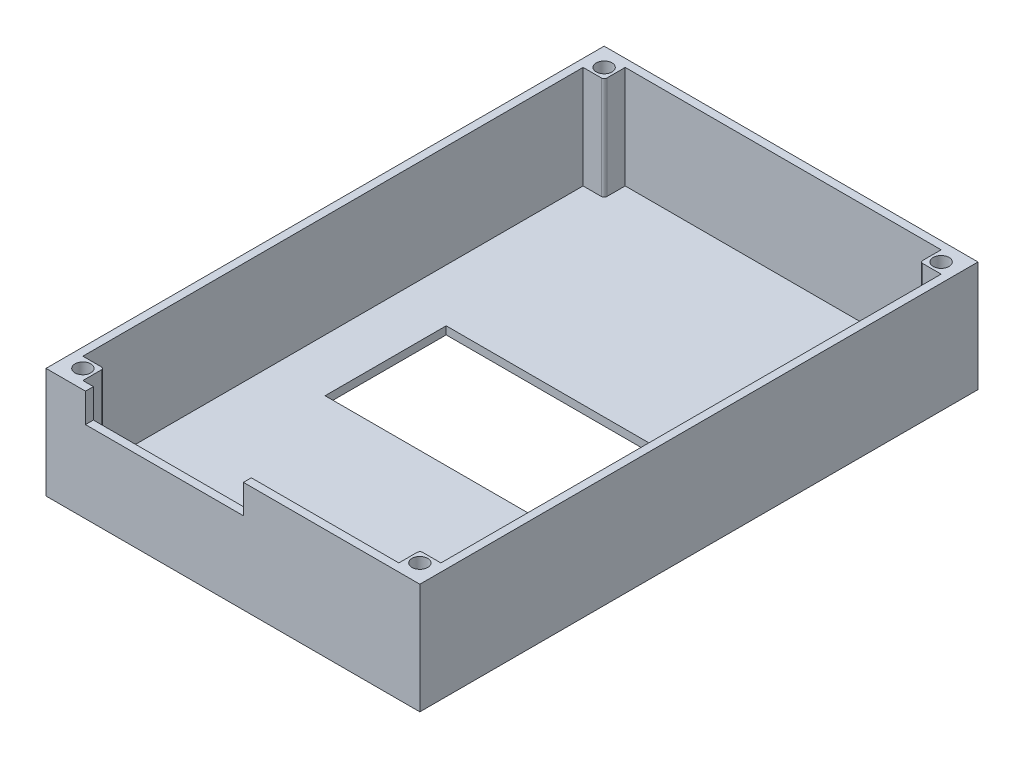
ISO-10303-21;
HEADER;
FILE_DESCRIPTION(('STEP AP214'),'2;1');
FILE_NAME('part.step','',(''),(''),'','','');
FILE_SCHEMA(('AUTOMOTIVE_DESIGN { 1 0 10303 214 1 1 1 1 }'));
ENDSEC;
DATA;
#1=APPLICATION_CONTEXT('core data for automotive mechanical design processes');
#2=APPLICATION_PROTOCOL_DEFINITION('international standard','automotive_design',2000,#1);
#3=PRODUCT_CONTEXT('',#1,'mechanical');
#4=PRODUCT('Part','Part','',(#3));
#5=PRODUCT_RELATED_PRODUCT_CATEGORY('part','',(#4));
#6=PRODUCT_DEFINITION_FORMATION('','',#4);
#7=PRODUCT_DEFINITION_CONTEXT('part definition',#1,'design');
#8=PRODUCT_DEFINITION('design','',#6,#7);
#9=PRODUCT_DEFINITION_SHAPE('','',#8);
#10=(LENGTH_UNIT() NAMED_UNIT(*) SI_UNIT(.MILLI.,.METRE.));
#11=(NAMED_UNIT(*) PLANE_ANGLE_UNIT() SI_UNIT($,.RADIAN.));
#12=(NAMED_UNIT(*) SI_UNIT($,.STERADIAN.) SOLID_ANGLE_UNIT());
#13=UNCERTAINTY_MEASURE_WITH_UNIT(LENGTH_MEASURE(1.E-05),#10,'distance_accuracy_value','');
#14=(GEOMETRIC_REPRESENTATION_CONTEXT(3) GLOBAL_UNCERTAINTY_ASSIGNED_CONTEXT((#13)) GLOBAL_UNIT_ASSIGNED_CONTEXT((#10,
#11,#12)) REPRESENTATION_CONTEXT('',''));
#15=CARTESIAN_POINT('',(0.,0.,0.));
#16=DIRECTION('',(0.,0.,1.));
#17=DIRECTION('',(1.,0.,0.));
#18=AXIS2_PLACEMENT_3D('',#15,#16,#17);
#19=CARTESIAN_POINT('',(34.,21.,53.));
#20=DIRECTION('',(-1.,0.,0.));
#21=DIRECTION('',(0.,0.,1.));
#22=AXIS2_PLACEMENT_3D('',#19,#20,#21);
#23=PLANE('',#22);
#24=DIRECTION('',(0.,0.,-1.));
#25=VECTOR('',#24,1.);
#26=CARTESIAN_POINT('',(34.,1.5,0.));
#27=LINE('',#26,#25);
#28=CARTESIAN_POINT('',(34.,1.5,47.5));
#29=VERTEX_POINT('',#28);
#30=CARTESIAN_POINT('',(34.,1.5,-47.5));
#31=VERTEX_POINT('',#30);
#32=EDGE_CURVE('E461',#29,#31,#27,.T.);
#33=ORIENTED_EDGE('',*,*,#32,.F.);
#34=DIRECTION('',(0.,-1.,0.));
#35=VECTOR('',#34,1.);
#36=CARTESIAN_POINT('',(34.,26.6568542494924,47.5));
#37=LINE('',#36,#35);
#38=CARTESIAN_POINT('',(34.,21.,47.5));
#39=VERTEX_POINT('',#38);
#40=EDGE_CURVE('E291',#39,#29,#37,.T.);
#41=ORIENTED_EDGE('',*,*,#40,.F.);
#42=DIRECTION('',(0.,0.,-1.));
#43=VECTOR('',#42,1.);
#44=CARTESIAN_POINT('',(34.,21.,0.));
#45=LINE('',#44,#43);
#46=CARTESIAN_POINT('',(34.,21.,-47.5));
#47=VERTEX_POINT('',#46);
#48=EDGE_CURVE('E483',#39,#47,#45,.T.);
#49=ORIENTED_EDGE('',*,*,#48,.T.);
#50=DIRECTION('',(0.,-1.,0.));
#51=VECTOR('',#50,1.);
#52=CARTESIAN_POINT('',(34.,26.6568542494924,-47.5));
#53=LINE('',#52,#51);
#54=EDGE_CURVE('E345',#47,#31,#53,.T.);
#55=ORIENTED_EDGE('',*,*,#54,.T.);
#56=EDGE_LOOP('',(#33,#41,#49,#55));
#57=FACE_BOUND('',#56,.T.);
#58=ADVANCED_FACE('F39',(#57),#23,.T.);
#59=CARTESIAN_POINT('',(-35.5,21.,51.5));
#60=DIRECTION('',(0.,0.,-1.));
#61=DIRECTION('',(-1.,0.,0.));
#62=AXIS2_PLACEMENT_3D('',#59,#60,#61);
#63=PLANE('',#62);
#64=DIRECTION('',(1.,0.,0.));
#65=VECTOR('',#64,1.);
#66=CARTESIAN_POINT('',(0.,21.,51.5));
#67=LINE('',#66,#65);
#68=CARTESIAN_POINT('',(1.99999999999998,21.,51.5));
#69=VERTEX_POINT('',#68);
#70=CARTESIAN_POINT('',(30.,21.,51.5));
#71=VERTEX_POINT('',#70);
#72=EDGE_CURVE('E493',#69,#71,#67,.T.);
#73=ORIENTED_EDGE('',*,*,#72,.T.);
#74=DIRECTION('',(0.,-1.,0.));
#75=VECTOR('',#74,1.);
#76=CARTESIAN_POINT('',(30.,26.6568542494924,51.5));
#77=LINE('',#76,#75);
#78=CARTESIAN_POINT('',(30.,1.5,51.5));
#79=VERTEX_POINT('',#78);
#80=EDGE_CURVE('E278',#71,#79,#77,.T.);
#81=ORIENTED_EDGE('',*,*,#80,.T.);
#82=DIRECTION('',(1.,0.,0.));
#83=VECTOR('',#82,1.);
#84=CARTESIAN_POINT('',(0.,1.5,51.5));
#85=LINE('',#84,#83);
#86=CARTESIAN_POINT('',(-30.,1.5,51.5));
#87=VERTEX_POINT('',#86);
#88=EDGE_CURVE('E480',#87,#79,#85,.T.);
#89=ORIENTED_EDGE('',*,*,#88,.F.);
#90=DIRECTION('',(0.,-1.,0.));
#91=VECTOR('',#90,1.);
#92=CARTESIAN_POINT('',(-30.,26.6568542494924,51.5));
#93=LINE('',#92,#91);
#94=CARTESIAN_POINT('',(-30.,21.,51.5));
#95=VERTEX_POINT('',#94);
#96=EDGE_CURVE('E369',#95,#87,#93,.T.);
#97=ORIENTED_EDGE('',*,*,#96,.F.);
#98=CARTESIAN_POINT('',(-28.,21.,51.5));
#99=VERTEX_POINT('',#98);
#100=EDGE_CURVE('E494',#95,#99,#67,.T.);
#101=ORIENTED_EDGE('',*,*,#100,.T.);
#102=DIRECTION('',(0.,1.,0.));
#103=VECTOR('',#102,1.);
#104=CARTESIAN_POINT('',(-28.,21.,51.5));
#105=LINE('',#104,#103);
#106=CARTESIAN_POINT('',(-28.,15.5,51.5));
#107=VERTEX_POINT('',#106);
#108=EDGE_CURVE('E548',#107,#99,#105,.T.);
#109=ORIENTED_EDGE('',*,*,#108,.F.);
#110=DIRECTION('',(-1.,0.,0.));
#111=VECTOR('',#110,1.);
#112=CARTESIAN_POINT('',(-35.5,15.5,51.5));
#113=LINE('',#112,#111);
#114=CARTESIAN_POINT('',(1.99999999999997,15.5,51.5));
#115=VERTEX_POINT('',#114);
#116=EDGE_CURVE('E541',#115,#107,#113,.T.);
#117=ORIENTED_EDGE('',*,*,#116,.F.);
#118=DIRECTION('',(0.,-1.,0.));
#119=VECTOR('',#118,1.);
#120=CARTESIAN_POINT('',(1.99999999999997,21.,51.5));
#121=LINE('',#120,#119);
#122=EDGE_CURVE('E544',#69,#115,#121,.T.);
#123=ORIENTED_EDGE('',*,*,#122,.F.);
#124=EDGE_LOOP('',(#73,#81,#89,#97,#101,#109,#117,#123));
#125=FACE_BOUND('',#124,.T.);
#126=ADVANCED_FACE('F586',(#125),#63,.T.);
#127=CARTESIAN_POINT('',(-35.5,21.,-51.5));
#128=DIRECTION('',(0.,0.,1.));
#129=DIRECTION('',(1.,0.,0.));
#130=AXIS2_PLACEMENT_3D('',#127,#128,#129);
#131=PLANE('',#130);
#132=DIRECTION('',(0.,-1.,0.));
#133=VECTOR('',#132,1.);
#134=CARTESIAN_POINT('',(30.,26.6568542494924,-51.5));
#135=LINE('',#134,#133);
#136=CARTESIAN_POINT('',(30.,21.,-51.5));
#137=VERTEX_POINT('',#136);
#138=CARTESIAN_POINT('',(30.,1.5,-51.5));
#139=VERTEX_POINT('',#138);
#140=EDGE_CURVE('E331',#137,#139,#135,.T.);
#141=ORIENTED_EDGE('',*,*,#140,.F.);
#142=DIRECTION('',(-1.,0.,0.));
#143=VECTOR('',#142,1.);
#144=CARTESIAN_POINT('',(0.,21.,-51.5));
#145=LINE('',#144,#143);
#146=CARTESIAN_POINT('',(-30.,21.,-51.5));
#147=VERTEX_POINT('',#146);
#148=EDGE_CURVE('E486',#137,#147,#145,.T.);
#149=ORIENTED_EDGE('',*,*,#148,.T.);
#150=DIRECTION('',(0.,-1.,0.));
#151=VECTOR('',#150,1.);
#152=CARTESIAN_POINT('',(-30.,26.6568542494924,-51.5));
#153=LINE('',#152,#151);
#154=CARTESIAN_POINT('',(-30.,1.5,-51.5));
#155=VERTEX_POINT('',#154);
#156=EDGE_CURVE('E403',#147,#155,#153,.T.);
#157=ORIENTED_EDGE('',*,*,#156,.T.);
#158=DIRECTION('',(-1.,0.,0.));
#159=VECTOR('',#158,1.);
#160=CARTESIAN_POINT('',(0.,1.5,-51.5));
#161=LINE('',#160,#159);
#162=EDGE_CURVE('E473',#139,#155,#161,.T.);
#163=ORIENTED_EDGE('',*,*,#162,.F.);
#164=EDGE_LOOP('',(#141,#149,#157,#163));
#165=FACE_BOUND('',#164,.T.);
#166=ADVANCED_FACE('F592',(#165),#131,.T.);
#167=CARTESIAN_POINT('',(-34.,21.,53.));
#168=DIRECTION('',(1.,0.,0.));
#169=DIRECTION('',(0.,0.,-1.));
#170=AXIS2_PLACEMENT_3D('',#167,#168,#169);
#171=PLANE('',#170);
#172=DIRECTION('',(0.,-1.,0.));
#173=VECTOR('',#172,1.);
#174=CARTESIAN_POINT('',(-34.,26.6568542494924,47.5));
#175=LINE('',#174,#173);
#176=CARTESIAN_POINT('',(-34.,21.,47.5));
#177=VERTEX_POINT('',#176);
#178=CARTESIAN_POINT('',(-34.,1.5,47.5));
#179=VERTEX_POINT('',#178);
#180=EDGE_CURVE('E383',#177,#179,#175,.T.);
#181=ORIENTED_EDGE('',*,*,#180,.T.);
#182=DIRECTION('',(0.,0.,1.));
#183=VECTOR('',#182,1.);
#184=CARTESIAN_POINT('',(-34.,1.5,0.));
#185=LINE('',#184,#183);
#186=CARTESIAN_POINT('',(-34.,1.5,-47.5));
#187=VERTEX_POINT('',#186);
#188=EDGE_CURVE('E476',#187,#179,#185,.T.);
#189=ORIENTED_EDGE('',*,*,#188,.F.);
#190=DIRECTION('',(0.,-1.,0.));
#191=VECTOR('',#190,1.);
#192=CARTESIAN_POINT('',(-34.,26.6568542494924,-47.5));
#193=LINE('',#192,#191);
#194=CARTESIAN_POINT('',(-34.,21.,-47.5));
#195=VERTEX_POINT('',#194);
#196=EDGE_CURVE('E416',#195,#187,#193,.T.);
#197=ORIENTED_EDGE('',*,*,#196,.F.);
#198=DIRECTION('',(0.,0.,1.));
#199=VECTOR('',#198,1.);
#200=CARTESIAN_POINT('',(-34.,21.,0.));
#201=LINE('',#200,#199);
#202=EDGE_CURVE('E489',#195,#177,#201,.T.);
#203=ORIENTED_EDGE('',*,*,#202,.T.);
#204=EDGE_LOOP('',(#181,#189,#197,#203));
#205=FACE_BOUND('',#204,.T.);
#206=ADVANCED_FACE('F601',(#205),#171,.T.);
#207=CARTESIAN_POINT('',(0.,21.,0.));
#208=DIRECTION('',(0.,-1.,0.));
#209=DIRECTION('',(0.,0.,-1.));
#210=AXIS2_PLACEMENT_3D('',#207,#208,#209);
#211=PLANE('',#210);
#212=ORIENTED_EDGE('',*,*,#48,.F.);
#213=DIRECTION('',(1.,0.,0.));
#214=VECTOR('',#213,1.);
#215=CARTESIAN_POINT('',(34.,21.,47.5));
#216=LINE('',#215,#214);
#217=CARTESIAN_POINT('',(30.5,21.,47.5));
#218=VERTEX_POINT('',#217);
#219=EDGE_CURVE('E295',#218,#39,#216,.T.);
#220=ORIENTED_EDGE('',*,*,#219,.F.);
#221=CARTESIAN_POINT('',(30.5,21.,48.));
#222=DIRECTION('',(0.,-1.,0.));
#223=DIRECTION('',(0.,0.,-1.));
#224=AXIS2_PLACEMENT_3D('',#221,#222,#223);
#225=CIRCLE('',#224,0.500000000000006);
#226=CARTESIAN_POINT('',(30.,21.,48.));
#227=VERTEX_POINT('',#226);
#228=EDGE_CURVE('E290',#227,#218,#225,.T.);
#229=ORIENTED_EDGE('',*,*,#228,.F.);
#230=DIRECTION('',(0.,0.,-1.));
#231=VECTOR('',#230,1.);
#232=CARTESIAN_POINT('',(30.,21.,51.5));
#233=LINE('',#232,#231);
#234=EDGE_CURVE('E284',#71,#227,#233,.T.);
#235=ORIENTED_EDGE('',*,*,#234,.F.);
#236=ORIENTED_EDGE('',*,*,#72,.F.);
#237=DIRECTION('',(0.,0.,1.));
#238=VECTOR('',#237,1.);
#239=CARTESIAN_POINT('',(1.99999999999998,21.,32.));
#240=LINE('',#239,#238);
#241=CARTESIAN_POINT('',(1.99999999999998,21.,53.));
#242=VERTEX_POINT('',#241);
#243=EDGE_CURVE('E462',#69,#242,#240,.T.);
#244=ORIENTED_EDGE('',*,*,#243,.T.);
#245=DIRECTION('',(1.,0.,0.));
#246=VECTOR('',#245,1.);
#247=CARTESIAN_POINT('',(-35.5,21.,53.));
#248=LINE('',#247,#246);
#249=CARTESIAN_POINT('',(35.5,21.,53.));
#250=VERTEX_POINT('',#249);
#251=EDGE_CURVE('E509',#242,#250,#248,.T.);
#252=ORIENTED_EDGE('',*,*,#251,.T.);
#253=DIRECTION('',(0.,0.,-1.));
#254=VECTOR('',#253,1.);
#255=CARTESIAN_POINT('',(35.5,21.,53.));
#256=LINE('',#255,#254);
#257=CARTESIAN_POINT('',(35.5,21.,-53.));
#258=VERTEX_POINT('',#257);
#259=EDGE_CURVE('E498',#250,#258,#256,.T.);
#260=ORIENTED_EDGE('',*,*,#259,.T.);
#261=DIRECTION('',(-1.,0.,0.));
#262=VECTOR('',#261,1.);
#263=CARTESIAN_POINT('',(-35.5,21.,-53.));
#264=LINE('',#263,#262);
#265=CARTESIAN_POINT('',(-35.5,21.,-53.));
#266=VERTEX_POINT('',#265);
#267=EDGE_CURVE('E502',#258,#266,#264,.T.);
#268=ORIENTED_EDGE('',*,*,#267,.T.);
#269=DIRECTION('',(0.,0.,1.));
#270=VECTOR('',#269,1.);
#271=CARTESIAN_POINT('',(-35.5,21.,53.));
#272=LINE('',#271,#270);
#273=CARTESIAN_POINT('',(-35.5,21.,53.));
#274=VERTEX_POINT('',#273);
#275=EDGE_CURVE('E506',#266,#274,#272,.T.);
#276=ORIENTED_EDGE('',*,*,#275,.T.);
#277=CARTESIAN_POINT('',(-28.,21.,53.));
#278=VERTEX_POINT('',#277);
#279=EDGE_CURVE('E510',#274,#278,#248,.T.);
#280=ORIENTED_EDGE('',*,*,#279,.T.);
#281=DIRECTION('',(0.,0.,1.));
#282=VECTOR('',#281,1.);
#283=CARTESIAN_POINT('',(-28.,21.,32.));
#284=LINE('',#283,#282);
#285=EDGE_CURVE('E458',#99,#278,#284,.T.);
#286=ORIENTED_EDGE('',*,*,#285,.F.);
#287=ORIENTED_EDGE('',*,*,#100,.F.);
#288=DIRECTION('',(0.,0.,-1.));
#289=VECTOR('',#288,1.);
#290=CARTESIAN_POINT('',(-30.,21.,51.5));
#291=LINE('',#290,#289);
#292=CARTESIAN_POINT('',(-30.,21.,48.));
#293=VERTEX_POINT('',#292);
#294=EDGE_CURVE('E365',#95,#293,#291,.T.);
#295=ORIENTED_EDGE('',*,*,#294,.T.);
#296=CARTESIAN_POINT('',(-30.5,21.,48.));
#297=DIRECTION('',(0.,-1.,0.));
#298=DIRECTION('',(0.,0.,-1.));
#299=AXIS2_PLACEMENT_3D('',#296,#297,#298);
#300=CIRCLE('',#299,0.500000000000006);
#301=CARTESIAN_POINT('',(-30.5,21.,47.5));
#302=VERTEX_POINT('',#301);
#303=EDGE_CURVE('E366',#293,#302,#300,.F.);
#304=ORIENTED_EDGE('',*,*,#303,.T.);
#305=DIRECTION('',(-1.,0.,0.));
#306=VECTOR('',#305,1.);
#307=CARTESIAN_POINT('',(-34.,21.,47.5));
#308=LINE('',#307,#306);
#309=EDGE_CURVE('E361',#302,#177,#308,.T.);
#310=ORIENTED_EDGE('',*,*,#309,.T.);
#311=ORIENTED_EDGE('',*,*,#202,.F.);
#312=DIRECTION('',(-1.,0.,0.));
#313=VECTOR('',#312,1.);
#314=CARTESIAN_POINT('',(-34.,21.,-47.5));
#315=LINE('',#314,#313);
#316=CARTESIAN_POINT('',(-30.5,21.,-47.5));
#317=VERTEX_POINT('',#316);
#318=EDGE_CURVE('E420',#317,#195,#315,.T.);
#319=ORIENTED_EDGE('',*,*,#318,.F.);
#320=CARTESIAN_POINT('',(-30.5,21.,-48.));
#321=DIRECTION('',(0.,-1.,0.));
#322=DIRECTION('',(0.,0.,-1.));
#323=AXIS2_PLACEMENT_3D('',#320,#321,#322);
#324=CIRCLE('',#323,0.500000000000006);
#325=CARTESIAN_POINT('',(-30.,21.,-48.));
#326=VERTEX_POINT('',#325);
#327=EDGE_CURVE('E415',#326,#317,#324,.T.);
#328=ORIENTED_EDGE('',*,*,#327,.F.);
#329=DIRECTION('',(0.,0.,1.));
#330=VECTOR('',#329,1.);
#331=CARTESIAN_POINT('',(-30.,21.,-51.5));
#332=LINE('',#331,#330);
#333=EDGE_CURVE('E409',#147,#326,#332,.T.);
#334=ORIENTED_EDGE('',*,*,#333,.F.);
#335=ORIENTED_EDGE('',*,*,#148,.F.);
#336=DIRECTION('',(0.,0.,1.));
#337=VECTOR('',#336,1.);
#338=CARTESIAN_POINT('',(30.,21.,-51.5));
#339=LINE('',#338,#337);
#340=CARTESIAN_POINT('',(30.,21.,-48.));
#341=VERTEX_POINT('',#340);
#342=EDGE_CURVE('E327',#137,#341,#339,.T.);
#343=ORIENTED_EDGE('',*,*,#342,.T.);
#344=CARTESIAN_POINT('',(30.5,21.,-48.));
#345=DIRECTION('',(0.,-1.,0.));
#346=DIRECTION('',(0.,0.,-1.));
#347=AXIS2_PLACEMENT_3D('',#344,#345,#346);
#348=CIRCLE('',#347,0.500000000000006);
#349=CARTESIAN_POINT('',(30.5,21.,-47.5));
#350=VERTEX_POINT('',#349);
#351=EDGE_CURVE('E328',#341,#350,#348,.F.);
#352=ORIENTED_EDGE('',*,*,#351,.T.);
#353=DIRECTION('',(1.,0.,0.));
#354=VECTOR('',#353,1.);
#355=CARTESIAN_POINT('',(34.,21.,-47.5));
#356=LINE('',#355,#354);
#357=EDGE_CURVE('E322',#350,#47,#356,.T.);
#358=ORIENTED_EDGE('',*,*,#357,.T.);
#359=EDGE_LOOP('',(#212,#220,#229,#235,#236,#244,#252,#260,#268,#276,#280,#286,#287,#295,#304,
#310,#311,#319,#328,#334,#335,#343,#352,#358));
#360=FACE_BOUND('',#359,.T.);
#361=CARTESIAN_POINT('',(-32.,21.,-49.5));
#362=DIRECTION('',(0.,-1.,0.));
#363=DIRECTION('',(0.,0.,-1.));
#364=AXIS2_PLACEMENT_3D('',#361,#362,#363);
#365=CIRCLE('',#364,1.5);
#366=CARTESIAN_POINT('',(-32.,21.,-51.));
#367=VERTEX_POINT('',#366);
#368=EDGE_CURVE('E433',#367,#367,#365,.T.);
#369=ORIENTED_EDGE('',*,*,#368,.T.);
#370=EDGE_LOOP('',(#369));
#371=FACE_BOUND('',#370,.T.);
#372=CARTESIAN_POINT('',(-32.,21.,49.5));
#373=DIRECTION('',(0.,-1.,0.));
#374=DIRECTION('',(0.,0.,-1.));
#375=AXIS2_PLACEMENT_3D('',#372,#373,#374);
#376=CIRCLE('',#375,1.5);
#377=CARTESIAN_POINT('',(-32.,21.,48.));
#378=VERTEX_POINT('',#377);
#379=EDGE_CURVE('E364',#378,#378,#376,.F.);
#380=ORIENTED_EDGE('',*,*,#379,.F.);
#381=EDGE_LOOP('',(#380));
#382=FACE_BOUND('',#381,.T.);
#383=CARTESIAN_POINT('',(32.,21.,-49.5));
#384=DIRECTION('',(0.,-1.,0.));
#385=DIRECTION('',(0.,0.,-1.));
#386=AXIS2_PLACEMENT_3D('',#383,#384,#385);
#387=CIRCLE('',#386,1.5);
#388=CARTESIAN_POINT('',(32.,21.,-51.));
#389=VERTEX_POINT('',#388);
#390=EDGE_CURVE('E326',#389,#389,#387,.F.);
#391=ORIENTED_EDGE('',*,*,#390,.F.);
#392=EDGE_LOOP('',(#391));
#393=FACE_BOUND('',#392,.T.);
#394=CARTESIAN_POINT('',(32.,21.,49.5));
#395=DIRECTION('',(0.,-1.,0.));
#396=DIRECTION('',(0.,0.,-1.));
#397=AXIS2_PLACEMENT_3D('',#394,#395,#396);
#398=CIRCLE('',#397,1.5);
#399=CARTESIAN_POINT('',(32.,21.,48.));
#400=VERTEX_POINT('',#399);
#401=EDGE_CURVE('E308',#400,#400,#398,.T.);
#402=ORIENTED_EDGE('',*,*,#401,.T.);
#403=EDGE_LOOP('',(#402));
#404=FACE_BOUND('',#403,.T.);
#405=ADVANCED_FACE('F604',(#360,#371,#382,#393,#404),#211,.F.);
#406=CARTESIAN_POINT('',(35.5,21.,53.));
#407=DIRECTION('',(-1.,0.,0.));
#408=DIRECTION('',(0.,0.,1.));
#409=AXIS2_PLACEMENT_3D('',#406,#407,#408);
#410=PLANE('',#409);
#411=DIRECTION('',(0.,0.,-1.));
#412=VECTOR('',#411,1.);
#413=CARTESIAN_POINT('',(35.5,0.,53.));
#414=LINE('',#413,#412);
#415=CARTESIAN_POINT('',(35.5,0.,53.));
#416=VERTEX_POINT('',#415);
#417=CARTESIAN_POINT('',(35.5,0.,-53.));
#418=VERTEX_POINT('',#417);
#419=EDGE_CURVE('E497',#416,#418,#414,.T.);
#420=ORIENTED_EDGE('',*,*,#419,.T.);
#421=DIRECTION('',(0.,-1.,0.));
#422=VECTOR('',#421,1.);
#423=CARTESIAN_POINT('',(35.5,21.,-53.));
#424=LINE('',#423,#422);
#425=EDGE_CURVE('E537',#258,#418,#424,.T.);
#426=ORIENTED_EDGE('',*,*,#425,.F.);
#427=ORIENTED_EDGE('',*,*,#259,.F.);
#428=DIRECTION('',(0.,-1.,0.));
#429=VECTOR('',#428,1.);
#430=CARTESIAN_POINT('',(35.5,21.,53.));
#431=LINE('',#430,#429);
#432=EDGE_CURVE('E514',#250,#416,#431,.T.);
#433=ORIENTED_EDGE('',*,*,#432,.T.);
#434=EDGE_LOOP('',(#420,#426,#427,#433));
#435=FACE_BOUND('',#434,.T.);
#436=ADVANCED_FACE('F41',(#435),#410,.F.);
#437=CARTESIAN_POINT('',(-35.5,21.,-53.));
#438=DIRECTION('',(0.,0.,1.));
#439=DIRECTION('',(1.,0.,0.));
#440=AXIS2_PLACEMENT_3D('',#437,#438,#439);
#441=PLANE('',#440);
#442=DIRECTION('',(-1.,0.,0.));
#443=VECTOR('',#442,1.);
#444=CARTESIAN_POINT('',(-35.5,0.,-53.));
#445=LINE('',#444,#443);
#446=CARTESIAN_POINT('',(-35.5,0.,-53.));
#447=VERTEX_POINT('',#446);
#448=EDGE_CURVE('E518',#418,#447,#445,.T.);
#449=ORIENTED_EDGE('',*,*,#448,.T.);
#450=DIRECTION('',(0.,-1.,0.));
#451=VECTOR('',#450,1.);
#452=CARTESIAN_POINT('',(-35.5,21.,-53.));
#453=LINE('',#452,#451);
#454=EDGE_CURVE('E533',#266,#447,#453,.T.);
#455=ORIENTED_EDGE('',*,*,#454,.F.);
#456=ORIENTED_EDGE('',*,*,#267,.F.);
#457=ORIENTED_EDGE('',*,*,#425,.T.);
#458=EDGE_LOOP('',(#449,#455,#456,#457));
#459=FACE_BOUND('',#458,.T.);
#460=ADVANCED_FACE('F706',(#459),#441,.F.);
#461=CARTESIAN_POINT('',(-35.5,21.,53.));
#462=DIRECTION('',(1.,0.,0.));
#463=DIRECTION('',(0.,0.,-1.));
#464=AXIS2_PLACEMENT_3D('',#461,#462,#463);
#465=PLANE('',#464);
#466=DIRECTION('',(0.,0.,1.));
#467=VECTOR('',#466,1.);
#468=CARTESIAN_POINT('',(-35.5,0.,53.));
#469=LINE('',#468,#467);
#470=CARTESIAN_POINT('',(-35.5,0.,53.));
#471=VERTEX_POINT('',#470);
#472=EDGE_CURVE('E521',#447,#471,#469,.T.);
#473=ORIENTED_EDGE('',*,*,#472,.T.);
#474=DIRECTION('',(0.,-1.,0.));
#475=VECTOR('',#474,1.);
#476=CARTESIAN_POINT('',(-35.5,21.,53.));
#477=LINE('',#476,#475);
#478=EDGE_CURVE('E529',#274,#471,#477,.T.);
#479=ORIENTED_EDGE('',*,*,#478,.F.);
#480=ORIENTED_EDGE('',*,*,#275,.F.);
#481=ORIENTED_EDGE('',*,*,#454,.T.);
#482=EDGE_LOOP('',(#473,#479,#480,#481));
#483=FACE_BOUND('',#482,.T.);
#484=ADVANCED_FACE('F711',(#483),#465,.F.);
#485=CARTESIAN_POINT('',(-35.5,21.,53.));
#486=DIRECTION('',(0.,0.,-1.));
#487=DIRECTION('',(-1.,0.,0.));
#488=AXIS2_PLACEMENT_3D('',#485,#486,#487);
#489=PLANE('',#488);
#490=DIRECTION('',(1.,0.,0.));
#491=VECTOR('',#490,1.);
#492=CARTESIAN_POINT('',(-28.,15.5,53.));
#493=LINE('',#492,#491);
#494=CARTESIAN_POINT('',(-28.,15.5,53.));
#495=VERTEX_POINT('',#494);
#496=CARTESIAN_POINT('',(1.99999999999998,15.5,53.));
#497=VERTEX_POINT('',#496);
#498=EDGE_CURVE('E450',#495,#497,#493,.T.);
#499=ORIENTED_EDGE('',*,*,#498,.F.);
#500=DIRECTION('',(0.,-1.,0.));
#501=VECTOR('',#500,1.);
#502=CARTESIAN_POINT('',(-28.,21.,53.));
#503=LINE('',#502,#501);
#504=EDGE_CURVE('E446',#278,#495,#503,.T.);
#505=ORIENTED_EDGE('',*,*,#504,.F.);
#506=ORIENTED_EDGE('',*,*,#279,.F.);
#507=ORIENTED_EDGE('',*,*,#478,.T.);
#508=DIRECTION('',(1.,0.,0.));
#509=VECTOR('',#508,1.);
#510=CARTESIAN_POINT('',(-35.5,0.,53.));
#511=LINE('',#510,#509);
#512=EDGE_CURVE('E503',#471,#416,#511,.T.);
#513=ORIENTED_EDGE('',*,*,#512,.T.);
#514=ORIENTED_EDGE('',*,*,#432,.F.);
#515=ORIENTED_EDGE('',*,*,#251,.F.);
#516=DIRECTION('',(0.,1.,0.));
#517=VECTOR('',#516,1.);
#518=CARTESIAN_POINT('',(1.99999999999998,21.,53.));
#519=LINE('',#518,#517);
#520=EDGE_CURVE('E454',#497,#242,#519,.T.);
#521=ORIENTED_EDGE('',*,*,#520,.F.);
#522=EDGE_LOOP('',(#499,#505,#506,#507,#513,#514,#515,#521));
#523=FACE_BOUND('',#522,.T.);
#524=ADVANCED_FACE('F694',(#523),#489,.F.);
#525=CARTESIAN_POINT('',(0.,0.,0.));
#526=DIRECTION('',(0.,-1.,0.));
#527=DIRECTION('',(0.,0.,-1.));
#528=AXIS2_PLACEMENT_3D('',#525,#526,#527);
#529=PLANE('',#528);
#530=DIRECTION('',(0.,0.,1.));
#531=VECTOR('',#530,1.);
#532=CARTESIAN_POINT('',(-24.,0.,11.5));
#533=LINE('',#532,#531);
#534=CARTESIAN_POINT('',(-24.,0.,-11.5));
#535=VERTEX_POINT('',#534);
#536=CARTESIAN_POINT('',(-24.,0.,11.5));
#537=VERTEX_POINT('',#536);
#538=EDGE_CURVE('E227',#535,#537,#533,.T.);
#539=ORIENTED_EDGE('',*,*,#538,.T.);
#540=DIRECTION('',(1.,0.,0.));
#541=VECTOR('',#540,1.);
#542=CARTESIAN_POINT('',(24.,0.,11.5));
#543=LINE('',#542,#541);
#544=CARTESIAN_POINT('',(24.,0.,11.5));
#545=VERTEX_POINT('',#544);
#546=EDGE_CURVE('E237',#537,#545,#543,.T.);
#547=ORIENTED_EDGE('',*,*,#546,.T.);
#548=DIRECTION('',(0.,0.,-1.));
#549=VECTOR('',#548,1.);
#550=CARTESIAN_POINT('',(24.,0.,11.5));
#551=LINE('',#550,#549);
#552=CARTESIAN_POINT('',(24.,0.,-11.5));
#553=VERTEX_POINT('',#552);
#554=EDGE_CURVE('E55',#545,#553,#551,.T.);
#555=ORIENTED_EDGE('',*,*,#554,.T.);
#556=DIRECTION('',(-1.,0.,0.));
#557=VECTOR('',#556,1.);
#558=CARTESIAN_POINT('',(24.,0.,-11.5));
#559=LINE('',#558,#557);
#560=EDGE_CURVE('E234',#553,#535,#559,.T.);
#561=ORIENTED_EDGE('',*,*,#560,.T.);
#562=EDGE_LOOP('',(#539,#547,#555,#561));
#563=FACE_BOUND('',#562,.T.);
#564=ORIENTED_EDGE('',*,*,#419,.F.);
#565=ORIENTED_EDGE('',*,*,#512,.F.);
#566=ORIENTED_EDGE('',*,*,#472,.F.);
#567=ORIENTED_EDGE('',*,*,#448,.F.);
#568=EDGE_LOOP('',(#564,#565,#566,#567));
#569=FACE_BOUND('',#568,.T.);
#570=ADVANCED_FACE('F242',(#563,#569),#529,.T.);
#571=CARTESIAN_POINT('',(0.,1.5,0.));
#572=DIRECTION('',(0.,-1.,0.));
#573=DIRECTION('',(0.,0.,-1.));
#574=AXIS2_PLACEMENT_3D('',#571,#572,#573);
#575=PLANE('',#574);
#576=DIRECTION('',(1.,0.,0.));
#577=VECTOR('',#576,1.);
#578=CARTESIAN_POINT('',(24.,1.5,11.5));
#579=LINE('',#578,#577);
#580=CARTESIAN_POINT('',(-24.,1.5,11.5));
#581=VERTEX_POINT('',#580);
#582=CARTESIAN_POINT('',(24.,1.5,11.5));
#583=VERTEX_POINT('',#582);
#584=EDGE_CURVE('E259',#581,#583,#579,.T.);
#585=ORIENTED_EDGE('',*,*,#584,.F.);
#586=DIRECTION('',(0.,0.,1.));
#587=VECTOR('',#586,1.);
#588=CARTESIAN_POINT('',(-24.,1.5,11.5));
#589=LINE('',#588,#587);
#590=CARTESIAN_POINT('',(-24.,1.5,-11.5));
#591=VERTEX_POINT('',#590);
#592=EDGE_CURVE('E63',#591,#581,#589,.T.);
#593=ORIENTED_EDGE('',*,*,#592,.F.);
#594=DIRECTION('',(-1.,0.,0.));
#595=VECTOR('',#594,1.);
#596=CARTESIAN_POINT('',(24.,1.5,-11.5));
#597=LINE('',#596,#595);
#598=CARTESIAN_POINT('',(24.,1.5,-11.5));
#599=VERTEX_POINT('',#598);
#600=EDGE_CURVE('E246',#599,#591,#597,.T.);
#601=ORIENTED_EDGE('',*,*,#600,.F.);
#602=DIRECTION('',(0.,0.,-1.));
#603=VECTOR('',#602,1.);
#604=CARTESIAN_POINT('',(24.,1.5,11.5));
#605=LINE('',#604,#603);
#606=EDGE_CURVE('E250',#583,#599,#605,.T.);
#607=ORIENTED_EDGE('',*,*,#606,.F.);
#608=EDGE_LOOP('',(#585,#593,#601,#607));
#609=FACE_BOUND('',#608,.T.);
#610=DIRECTION('',(-1.,0.,0.));
#611=VECTOR('',#610,1.);
#612=CARTESIAN_POINT('',(34.,1.5,47.5));
#613=LINE('',#612,#611);
#614=CARTESIAN_POINT('',(30.5,1.5,47.5));
#615=VERTEX_POINT('',#614);
#616=EDGE_CURVE('E286',#29,#615,#613,.T.);
#617=ORIENTED_EDGE('',*,*,#616,.F.);
#618=ORIENTED_EDGE('',*,*,#32,.T.);
#619=DIRECTION('',(-1.,0.,0.));
#620=VECTOR('',#619,1.);
#621=CARTESIAN_POINT('',(34.,1.5,-47.5));
#622=LINE('',#621,#620);
#623=CARTESIAN_POINT('',(30.5,1.5,-47.5));
#624=VERTEX_POINT('',#623);
#625=EDGE_CURVE('E341',#31,#624,#622,.T.);
#626=ORIENTED_EDGE('',*,*,#625,.T.);
#627=CARTESIAN_POINT('',(30.5,1.5,-48.));
#628=DIRECTION('',(0.,-1.,0.));
#629=DIRECTION('',(0.,0.,1.));
#630=AXIS2_PLACEMENT_3D('',#627,#628,#629);
#631=CIRCLE('',#630,0.500000000000006);
#632=CARTESIAN_POINT('',(30.,1.5,-48.));
#633=VERTEX_POINT('',#632);
#634=EDGE_CURVE('E337',#624,#633,#631,.T.);
#635=ORIENTED_EDGE('',*,*,#634,.T.);
#636=DIRECTION('',(0.,0.,-1.));
#637=VECTOR('',#636,1.);
#638=CARTESIAN_POINT('',(30.,1.5,-51.5));
#639=LINE('',#638,#637);
#640=EDGE_CURVE('E321',#633,#139,#639,.T.);
#641=ORIENTED_EDGE('',*,*,#640,.T.);
#642=ORIENTED_EDGE('',*,*,#162,.T.);
#643=DIRECTION('',(0.,0.,-1.));
#644=VECTOR('',#643,1.);
#645=CARTESIAN_POINT('',(-30.,1.5,-51.5));
#646=LINE('',#645,#644);
#647=CARTESIAN_POINT('',(-30.,1.5,-48.));
#648=VERTEX_POINT('',#647);
#649=EDGE_CURVE('E399',#648,#155,#646,.T.);
#650=ORIENTED_EDGE('',*,*,#649,.F.);
#651=CARTESIAN_POINT('',(-30.5,1.5,-48.));
#652=DIRECTION('',(0.,1.,0.));
#653=DIRECTION('',(0.,0.,1.));
#654=AXIS2_PLACEMENT_3D('',#651,#652,#653);
#655=CIRCLE('',#654,0.500000000000006);
#656=CARTESIAN_POINT('',(-30.5,1.5,-47.5));
#657=VERTEX_POINT('',#656);
#658=EDGE_CURVE('E405',#657,#648,#655,.T.);
#659=ORIENTED_EDGE('',*,*,#658,.F.);
#660=DIRECTION('',(1.,0.,0.));
#661=VECTOR('',#660,1.);
#662=CARTESIAN_POINT('',(-34.,1.5,-47.5));
#663=LINE('',#662,#661);
#664=EDGE_CURVE('E411',#187,#657,#663,.T.);
#665=ORIENTED_EDGE('',*,*,#664,.F.);
#666=ORIENTED_EDGE('',*,*,#188,.T.);
#667=DIRECTION('',(1.,0.,0.));
#668=VECTOR('',#667,1.);
#669=CARTESIAN_POINT('',(-34.,1.5,47.5));
#670=LINE('',#669,#668);
#671=CARTESIAN_POINT('',(-30.5,1.5,47.5));
#672=VERTEX_POINT('',#671);
#673=EDGE_CURVE('E379',#179,#672,#670,.T.);
#674=ORIENTED_EDGE('',*,*,#673,.T.);
#675=CARTESIAN_POINT('',(-30.5,1.5,48.));
#676=DIRECTION('',(0.,-1.,0.));
#677=DIRECTION('',(0.,0.,-1.));
#678=AXIS2_PLACEMENT_3D('',#675,#676,#677);
#679=CIRCLE('',#678,0.500000000000006);
#680=CARTESIAN_POINT('',(-30.,1.5,48.));
#681=VERTEX_POINT('',#680);
#682=EDGE_CURVE('E375',#672,#681,#679,.T.);
#683=ORIENTED_EDGE('',*,*,#682,.T.);
#684=DIRECTION('',(0.,0.,1.));
#685=VECTOR('',#684,1.);
#686=CARTESIAN_POINT('',(-30.,1.5,51.5));
#687=LINE('',#686,#685);
#688=EDGE_CURVE('E360',#681,#87,#687,.T.);
#689=ORIENTED_EDGE('',*,*,#688,.T.);
#690=ORIENTED_EDGE('',*,*,#88,.T.);
#691=DIRECTION('',(0.,0.,1.));
#692=VECTOR('',#691,1.);
#693=CARTESIAN_POINT('',(30.,1.5,51.5));
#694=LINE('',#693,#692);
#695=CARTESIAN_POINT('',(30.,1.5,48.));
#696=VERTEX_POINT('',#695);
#697=EDGE_CURVE('E274',#696,#79,#694,.T.);
#698=ORIENTED_EDGE('',*,*,#697,.F.);
#699=CARTESIAN_POINT('',(30.5,1.5,48.));
#700=DIRECTION('',(0.,1.,0.));
#701=DIRECTION('',(0.,0.,-1.));
#702=AXIS2_PLACEMENT_3D('',#699,#700,#701);
#703=CIRCLE('',#702,0.500000000000006);
#704=EDGE_CURVE('E280',#615,#696,#703,.T.);
#705=ORIENTED_EDGE('',*,*,#704,.F.);
#706=EDGE_LOOP('',(#617,#618,#626,#635,#641,#642,#650,#659,#665,#666,#674,#683,#689,#690,#698,#705));
#707=FACE_BOUND('',#706,.T.);
#708=ADVANCED_FACE('F573',(#609,#707),#575,.F.);
#709=CARTESIAN_POINT('',(-28.,21.,32.));
#710=DIRECTION('',(-1.,0.,0.));
#711=DIRECTION('',(0.,0.,1.));
#712=AXIS2_PLACEMENT_3D('',#709,#710,#711);
#713=PLANE('',#712);
#714=ORIENTED_EDGE('',*,*,#108,.T.);
#715=ORIENTED_EDGE('',*,*,#285,.T.);
#716=ORIENTED_EDGE('',*,*,#504,.T.);
#717=DIRECTION('',(0.,0.,1.));
#718=VECTOR('',#717,1.);
#719=CARTESIAN_POINT('',(-28.,15.5,32.));
#720=LINE('',#719,#718);
#721=EDGE_CURVE('E457',#107,#495,#720,.T.);
#722=ORIENTED_EDGE('',*,*,#721,.F.);
#723=EDGE_LOOP('',(#714,#715,#716,#722));
#724=FACE_BOUND('',#723,.T.);
#725=ADVANCED_FACE('F597',(#724),#713,.F.);
#726=CARTESIAN_POINT('',(1.99999999999998,21.,32.));
#727=DIRECTION('',(1.,0.,0.));
#728=DIRECTION('',(0.,0.,-1.));
#729=AXIS2_PLACEMENT_3D('',#726,#727,#728);
#730=PLANE('',#729);
#731=ORIENTED_EDGE('',*,*,#122,.T.);
#732=DIRECTION('',(0.,0.,1.));
#733=VECTOR('',#732,1.);
#734=CARTESIAN_POINT('',(1.99999999999998,15.5,32.));
#735=LINE('',#734,#733);
#736=EDGE_CURVE('E466',#115,#497,#735,.T.);
#737=ORIENTED_EDGE('',*,*,#736,.T.);
#738=ORIENTED_EDGE('',*,*,#520,.T.);
#739=ORIENTED_EDGE('',*,*,#243,.F.);
#740=EDGE_LOOP('',(#731,#737,#738,#739));
#741=FACE_BOUND('',#740,.T.);
#742=ADVANCED_FACE('F678',(#741),#730,.F.);
#743=CARTESIAN_POINT('',(-28.,15.5,32.));
#744=DIRECTION('',(0.,-1.,0.));
#745=DIRECTION('',(0.,0.,-1.));
#746=AXIS2_PLACEMENT_3D('',#743,#744,#745);
#747=PLANE('',#746);
#748=ORIENTED_EDGE('',*,*,#116,.T.);
#749=ORIENTED_EDGE('',*,*,#721,.T.);
#750=ORIENTED_EDGE('',*,*,#498,.T.);
#751=ORIENTED_EDGE('',*,*,#736,.F.);
#752=EDGE_LOOP('',(#748,#749,#750,#751));
#753=FACE_BOUND('',#752,.T.);
#754=ADVANCED_FACE('F671',(#753),#747,.F.);
#755=CARTESIAN_POINT('',(-34.,26.6568542494924,-47.5));
#756=DIRECTION('',(0.,0.,-1.));
#757=DIRECTION('',(-1.,0.,0.));
#758=AXIS2_PLACEMENT_3D('',#755,#756,#757);
#759=PLANE('',#758);
#760=DIRECTION('',(0.,-1.,0.));
#761=VECTOR('',#760,1.);
#762=CARTESIAN_POINT('',(-30.5,26.6568542494924,-47.5));
#763=LINE('',#762,#761);
#764=EDGE_CURVE('E410',#317,#657,#763,.T.);
#765=ORIENTED_EDGE('',*,*,#764,.F.);
#766=ORIENTED_EDGE('',*,*,#318,.T.);
#767=ORIENTED_EDGE('',*,*,#196,.T.);
#768=ORIENTED_EDGE('',*,*,#664,.T.);
#769=EDGE_LOOP('',(#765,#766,#767,#768));
#770=FACE_BOUND('',#769,.T.);
#771=ADVANCED_FACE('F618',(#770),#759,.F.);
#772=CARTESIAN_POINT('',(-30.5,26.6568542494924,-48.));
#773=DIRECTION('',(0.,-1.,0.));
#774=DIRECTION('',(0.,0.,-1.));
#775=AXIS2_PLACEMENT_3D('',#772,#773,#774);
#776=CYLINDRICAL_SURFACE('',#775,0.500000000000006);
#777=DIRECTION('',(0.,-1.,0.));
#778=VECTOR('',#777,1.);
#779=CARTESIAN_POINT('',(-30.,26.6568542494924,-48.));
#780=LINE('',#779,#778);
#781=EDGE_CURVE('E404',#326,#648,#780,.T.);
#782=ORIENTED_EDGE('',*,*,#781,.F.);
#783=ORIENTED_EDGE('',*,*,#327,.T.);
#784=ORIENTED_EDGE('',*,*,#764,.T.);
#785=ORIENTED_EDGE('',*,*,#658,.T.);
#786=EDGE_LOOP('',(#782,#783,#784,#785));
#787=FACE_BOUND('',#786,.T.);
#788=ADVANCED_FACE('F663',(#787),#776,.T.);
#789=CARTESIAN_POINT('',(-30.,26.6568542494924,-51.5));
#790=DIRECTION('',(-1.,0.,0.));
#791=DIRECTION('',(0.,0.,1.));
#792=AXIS2_PLACEMENT_3D('',#789,#790,#791);
#793=PLANE('',#792);
#794=ORIENTED_EDGE('',*,*,#156,.F.);
#795=ORIENTED_EDGE('',*,*,#333,.T.);
#796=ORIENTED_EDGE('',*,*,#781,.T.);
#797=ORIENTED_EDGE('',*,*,#649,.T.);
#798=EDGE_LOOP('',(#794,#795,#796,#797));
#799=FACE_BOUND('',#798,.T.);
#800=ADVANCED_FACE('F661',(#799),#793,.F.);
#801=CARTESIAN_POINT('',(-32.,26.6568542494924,-49.5));
#802=DIRECTION('',(0.,-1.,0.));
#803=DIRECTION('',(0.,0.,-1.));
#804=AXIS2_PLACEMENT_3D('',#801,#802,#803);
#805=CYLINDRICAL_SURFACE('',#804,1.5);
#806=ORIENTED_EDGE('',*,*,#368,.F.);
#807=EDGE_LOOP('',(#806));
#808=FACE_BOUND('',#807,.T.);
#809=CARTESIAN_POINT('',(-32.,1.5,-49.5));
#810=DIRECTION('',(0.,1.,0.));
#811=DIRECTION('',(0.,0.,1.));
#812=AXIS2_PLACEMENT_3D('',#809,#810,#811);
#813=CIRCLE('',#812,1.5);
#814=CARTESIAN_POINT('',(-32.,1.5,-48.));
#815=VERTEX_POINT('',#814);
#816=EDGE_CURVE('E398',#815,#815,#813,.T.);
#817=ORIENTED_EDGE('',*,*,#816,.F.);
#818=EDGE_LOOP('',(#817));
#819=FACE_BOUND('',#818,.T.);
#820=ADVANCED_FACE('F578',(#808,#819),#805,.F.);
#821=ORIENTED_EDGE('',*,*,#816,.T.);
#822=EDGE_LOOP('',(#821));
#823=FACE_BOUND('',#822,.T.);
#824=ADVANCED_FACE('F561',(#823),#575,.F.);
#825=CARTESIAN_POINT('',(-34.,26.6568542494924,47.5));
#826=DIRECTION('',(0.,0.,-1.));
#827=DIRECTION('',(-1.,0.,0.));
#828=AXIS2_PLACEMENT_3D('',#825,#826,#827);
#829=PLANE('',#828);
#830=ORIENTED_EDGE('',*,*,#309,.F.);
#831=DIRECTION('',(0.,-1.,0.));
#832=VECTOR('',#831,1.);
#833=CARTESIAN_POINT('',(-30.5,26.6568542494924,47.5));
#834=LINE('',#833,#832);
#835=EDGE_CURVE('E387',#302,#672,#834,.T.);
#836=ORIENTED_EDGE('',*,*,#835,.T.);
#837=ORIENTED_EDGE('',*,*,#673,.F.);
#838=ORIENTED_EDGE('',*,*,#180,.F.);
#839=EDGE_LOOP('',(#830,#836,#837,#838));
#840=FACE_BOUND('',#839,.T.);
#841=ADVANCED_FACE('F577',(#840),#829,.T.);
#842=CARTESIAN_POINT('',(-30.5,26.6568542494924,48.));
#843=DIRECTION('',(0.,-1.,0.));
#844=DIRECTION('',(0.,0.,-1.));
#845=AXIS2_PLACEMENT_3D('',#842,#843,#844);
#846=CYLINDRICAL_SURFACE('',#845,0.500000000000006);
#847=ORIENTED_EDGE('',*,*,#303,.F.);
#848=DIRECTION('',(0.,-1.,0.));
#849=VECTOR('',#848,1.);
#850=CARTESIAN_POINT('',(-30.,26.6568542494924,48.));
#851=LINE('',#850,#849);
#852=EDGE_CURVE('E390',#293,#681,#851,.T.);
#853=ORIENTED_EDGE('',*,*,#852,.T.);
#854=ORIENTED_EDGE('',*,*,#682,.F.);
#855=ORIENTED_EDGE('',*,*,#835,.F.);
#856=EDGE_LOOP('',(#847,#853,#854,#855));
#857=FACE_BOUND('',#856,.T.);
#858=ADVANCED_FACE('F625',(#857),#846,.T.);
#859=CARTESIAN_POINT('',(-30.,26.6568542494924,51.5));
#860=DIRECTION('',(1.,0.,0.));
#861=DIRECTION('',(0.,0.,-1.));
#862=AXIS2_PLACEMENT_3D('',#859,#860,#861);
#863=PLANE('',#862);
#864=ORIENTED_EDGE('',*,*,#294,.F.);
#865=ORIENTED_EDGE('',*,*,#96,.T.);
#866=ORIENTED_EDGE('',*,*,#688,.F.);
#867=ORIENTED_EDGE('',*,*,#852,.F.);
#868=EDGE_LOOP('',(#864,#865,#866,#867));
#869=FACE_BOUND('',#868,.T.);
#870=ADVANCED_FACE('F570',(#869),#863,.T.);
#871=CARTESIAN_POINT('',(-32.,26.6568542494924,49.5));
#872=DIRECTION('',(0.,-1.,0.));
#873=DIRECTION('',(0.,0.,-1.));
#874=AXIS2_PLACEMENT_3D('',#871,#872,#873);
#875=CYLINDRICAL_SURFACE('',#874,1.5);
#876=ORIENTED_EDGE('',*,*,#379,.T.);
#877=EDGE_LOOP('',(#876));
#878=FACE_BOUND('',#877,.T.);
#879=CARTESIAN_POINT('',(-32.,1.5,49.5));
#880=DIRECTION('',(0.,-1.,0.));
#881=DIRECTION('',(0.,0.,-1.));
#882=AXIS2_PLACEMENT_3D('',#879,#880,#881);
#883=CIRCLE('',#882,1.5);
#884=CARTESIAN_POINT('',(-32.,1.5,48.));
#885=VERTEX_POINT('',#884);
#886=EDGE_CURVE('E48',#885,#885,#883,.T.);
#887=ORIENTED_EDGE('',*,*,#886,.T.);
#888=EDGE_LOOP('',(#887));
#889=FACE_BOUND('',#888,.T.);
#890=ADVANCED_FACE('F555',(#878,#889),#875,.F.);
#891=ORIENTED_EDGE('',*,*,#886,.F.);
#892=EDGE_LOOP('',(#891));
#893=FACE_BOUND('',#892,.T.);
#894=ADVANCED_FACE('F557',(#893),#575,.F.);
#895=CARTESIAN_POINT('',(34.,26.6568542494924,-47.5));
#896=DIRECTION('',(0.,0.,1.));
#897=DIRECTION('',(1.,0.,0.));
#898=AXIS2_PLACEMENT_3D('',#895,#896,#897);
#899=PLANE('',#898);
#900=ORIENTED_EDGE('',*,*,#357,.F.);
#901=DIRECTION('',(0.,-1.,0.));
#902=VECTOR('',#901,1.);
#903=CARTESIAN_POINT('',(30.5,26.6568542494924,-47.5));
#904=LINE('',#903,#902);
#905=EDGE_CURVE('E349',#350,#624,#904,.T.);
#906=ORIENTED_EDGE('',*,*,#905,.T.);
#907=ORIENTED_EDGE('',*,*,#625,.F.);
#908=ORIENTED_EDGE('',*,*,#54,.F.);
#909=EDGE_LOOP('',(#900,#906,#907,#908));
#910=FACE_BOUND('',#909,.T.);
#911=ADVANCED_FACE('F559',(#910),#899,.T.);
#912=CARTESIAN_POINT('',(30.5,26.6568542494924,-48.));
#913=DIRECTION('',(0.,-1.,0.));
#914=DIRECTION('',(0.,0.,-1.));
#915=AXIS2_PLACEMENT_3D('',#912,#913,#914);
#916=CYLINDRICAL_SURFACE('',#915,0.500000000000006);
#917=ORIENTED_EDGE('',*,*,#351,.F.);
#918=DIRECTION('',(0.,-1.,0.));
#919=VECTOR('',#918,1.);
#920=CARTESIAN_POINT('',(30.,26.6568542494924,-48.));
#921=LINE('',#920,#919);
#922=EDGE_CURVE('E352',#341,#633,#921,.T.);
#923=ORIENTED_EDGE('',*,*,#922,.T.);
#924=ORIENTED_EDGE('',*,*,#634,.F.);
#925=ORIENTED_EDGE('',*,*,#905,.F.);
#926=EDGE_LOOP('',(#917,#923,#924,#925));
#927=FACE_BOUND('',#926,.T.);
#928=ADVANCED_FACE('F567',(#927),#916,.T.);
#929=CARTESIAN_POINT('',(30.,26.6568542494924,-51.5));
#930=DIRECTION('',(-1.,0.,0.));
#931=DIRECTION('',(0.,0.,1.));
#932=AXIS2_PLACEMENT_3D('',#929,#930,#931);
#933=PLANE('',#932);
#934=ORIENTED_EDGE('',*,*,#342,.F.);
#935=ORIENTED_EDGE('',*,*,#140,.T.);
#936=ORIENTED_EDGE('',*,*,#640,.F.);
#937=ORIENTED_EDGE('',*,*,#922,.F.);
#938=EDGE_LOOP('',(#934,#935,#936,#937));
#939=FACE_BOUND('',#938,.T.);
#940=ADVANCED_FACE('F654',(#939),#933,.T.);
#941=CARTESIAN_POINT('',(32.,26.6568542494924,-49.5));
#942=DIRECTION('',(0.,-1.,0.));
#943=DIRECTION('',(0.,0.,-1.));
#944=AXIS2_PLACEMENT_3D('',#941,#942,#943);
#945=CYLINDRICAL_SURFACE('',#944,1.5);
#946=ORIENTED_EDGE('',*,*,#390,.T.);
#947=EDGE_LOOP('',(#946));
#948=FACE_BOUND('',#947,.T.);
#949=CARTESIAN_POINT('',(32.,1.5,-49.5));
#950=DIRECTION('',(0.,-1.,0.));
#951=DIRECTION('',(0.,0.,-1.));
#952=AXIS2_PLACEMENT_3D('',#949,#950,#951);
#953=CIRCLE('',#952,1.5);
#954=CARTESIAN_POINT('',(32.,1.5,-51.));
#955=VERTEX_POINT('',#954);
#956=EDGE_CURVE('E11',#955,#955,#953,.T.);
#957=ORIENTED_EDGE('',*,*,#956,.T.);
#958=EDGE_LOOP('',(#957));
#959=FACE_BOUND('',#958,.T.);
#960=ADVANCED_FACE('F582',(#948,#959),#945,.F.);
#961=ORIENTED_EDGE('',*,*,#956,.F.);
#962=EDGE_LOOP('',(#961));
#963=FACE_BOUND('',#962,.T.);
#964=ADVANCED_FACE('F562',(#963),#575,.F.);
#965=CARTESIAN_POINT('',(34.,26.6568542494924,47.5));
#966=DIRECTION('',(0.,0.,1.));
#967=DIRECTION('',(1.,0.,0.));
#968=AXIS2_PLACEMENT_3D('',#965,#966,#967);
#969=PLANE('',#968);
#970=DIRECTION('',(0.,-1.,0.));
#971=VECTOR('',#970,1.);
#972=CARTESIAN_POINT('',(30.5,26.6568542494924,47.5));
#973=LINE('',#972,#971);
#974=EDGE_CURVE('E285',#218,#615,#973,.T.);
#975=ORIENTED_EDGE('',*,*,#974,.F.);
#976=ORIENTED_EDGE('',*,*,#219,.T.);
#977=ORIENTED_EDGE('',*,*,#40,.T.);
#978=ORIENTED_EDGE('',*,*,#616,.T.);
#979=EDGE_LOOP('',(#975,#976,#977,#978));
#980=FACE_BOUND('',#979,.T.);
#981=ADVANCED_FACE('F581',(#980),#969,.F.);
#982=CARTESIAN_POINT('',(30.5,26.6568542494924,48.));
#983=DIRECTION('',(0.,-1.,0.));
#984=DIRECTION('',(0.,0.,-1.));
#985=AXIS2_PLACEMENT_3D('',#982,#983,#984);
#986=CYLINDRICAL_SURFACE('',#985,0.500000000000006);
#987=DIRECTION('',(0.,-1.,0.));
#988=VECTOR('',#987,1.);
#989=CARTESIAN_POINT('',(30.,26.6568542494924,48.));
#990=LINE('',#989,#988);
#991=EDGE_CURVE('E279',#227,#696,#990,.T.);
#992=ORIENTED_EDGE('',*,*,#991,.F.);
#993=ORIENTED_EDGE('',*,*,#228,.T.);
#994=ORIENTED_EDGE('',*,*,#974,.T.);
#995=ORIENTED_EDGE('',*,*,#704,.T.);
#996=EDGE_LOOP('',(#992,#993,#994,#995));
#997=FACE_BOUND('',#996,.T.);
#998=ADVANCED_FACE('F641',(#997),#986,.T.);
#999=CARTESIAN_POINT('',(30.,26.6568542494924,51.5));
#1000=DIRECTION('',(1.,0.,0.));
#1001=DIRECTION('',(0.,0.,-1.));
#1002=AXIS2_PLACEMENT_3D('',#999,#1000,#1001);
#1003=PLANE('',#1002);
#1004=ORIENTED_EDGE('',*,*,#80,.F.);
#1005=ORIENTED_EDGE('',*,*,#234,.T.);
#1006=ORIENTED_EDGE('',*,*,#991,.T.);
#1007=ORIENTED_EDGE('',*,*,#697,.T.);
#1008=EDGE_LOOP('',(#1004,#1005,#1006,#1007));
#1009=FACE_BOUND('',#1008,.T.);
#1010=ADVANCED_FACE('F637',(#1009),#1003,.F.);
#1011=CARTESIAN_POINT('',(32.,26.6568542494924,49.5));
#1012=DIRECTION('',(0.,-1.,0.));
#1013=DIRECTION('',(0.,0.,-1.));
#1014=AXIS2_PLACEMENT_3D('',#1011,#1012,#1013);
#1015=CYLINDRICAL_SURFACE('',#1014,1.5);
#1016=ORIENTED_EDGE('',*,*,#401,.F.);
#1017=EDGE_LOOP('',(#1016));
#1018=FACE_BOUND('',#1017,.T.);
#1019=CARTESIAN_POINT('',(32.,1.5,49.5));
#1020=DIRECTION('',(0.,1.,0.));
#1021=DIRECTION('',(0.,0.,-1.));
#1022=AXIS2_PLACEMENT_3D('',#1019,#1020,#1021);
#1023=CIRCLE('',#1022,1.5);
#1024=CARTESIAN_POINT('',(32.,1.5,48.));
#1025=VERTEX_POINT('',#1024);
#1026=EDGE_CURVE('E268',#1025,#1025,#1023,.T.);
#1027=ORIENTED_EDGE('',*,*,#1026,.F.);
#1028=EDGE_LOOP('',(#1027));
#1029=FACE_BOUND('',#1028,.T.);
#1030=ADVANCED_FACE('F834',(#1018,#1029),#1015,.F.);
#1031=ORIENTED_EDGE('',*,*,#1026,.T.);
#1032=EDGE_LOOP('',(#1031));
#1033=FACE_BOUND('',#1032,.T.);
#1034=ADVANCED_FACE('F584',(#1033),#575,.F.);
#1035=CARTESIAN_POINT('',(-24.,0.,11.5));
#1036=DIRECTION('',(-1.,0.,0.));
#1037=DIRECTION('',(0.,0.,1.));
#1038=AXIS2_PLACEMENT_3D('',#1035,#1036,#1037);
#1039=PLANE('',#1038);
#1040=ORIENTED_EDGE('',*,*,#592,.T.);
#1041=DIRECTION('',(0.,1.,0.));
#1042=VECTOR('',#1041,1.);
#1043=CARTESIAN_POINT('',(-24.,0.,11.5));
#1044=LINE('',#1043,#1042);
#1045=EDGE_CURVE('E223',#537,#581,#1044,.T.);
#1046=ORIENTED_EDGE('',*,*,#1045,.F.);
#1047=ORIENTED_EDGE('',*,*,#538,.F.);
#1048=DIRECTION('',(0.,1.,0.));
#1049=VECTOR('',#1048,1.);
#1050=CARTESIAN_POINT('',(-24.,0.,-11.5));
#1051=LINE('',#1050,#1049);
#1052=EDGE_CURVE('E265',#535,#591,#1051,.T.);
#1053=ORIENTED_EDGE('',*,*,#1052,.T.);
#1054=EDGE_LOOP('',(#1040,#1046,#1047,#1053));
#1055=FACE_BOUND('',#1054,.T.);
#1056=ADVANCED_FACE('F225',(#1055),#1039,.F.);
#1057=CARTESIAN_POINT('',(24.,0.,-11.5));
#1058=DIRECTION('',(0.,0.,-1.));
#1059=DIRECTION('',(-1.,0.,0.));
#1060=AXIS2_PLACEMENT_3D('',#1057,#1058,#1059);
#1061=PLANE('',#1060);
#1062=ORIENTED_EDGE('',*,*,#600,.T.);
#1063=ORIENTED_EDGE('',*,*,#1052,.F.);
#1064=ORIENTED_EDGE('',*,*,#560,.F.);
#1065=DIRECTION('',(0.,1.,0.));
#1066=VECTOR('',#1065,1.);
#1067=CARTESIAN_POINT('',(24.,0.,-11.5));
#1068=LINE('',#1067,#1066);
#1069=EDGE_CURVE('E269',#553,#599,#1068,.T.);
#1070=ORIENTED_EDGE('',*,*,#1069,.T.);
#1071=EDGE_LOOP('',(#1062,#1063,#1064,#1070));
#1072=FACE_BOUND('',#1071,.T.);
#1073=ADVANCED_FACE('F874',(#1072),#1061,.F.);
#1074=CARTESIAN_POINT('',(24.,0.,11.5));
#1075=DIRECTION('',(1.,0.,0.));
#1076=DIRECTION('',(0.,0.,-1.));
#1077=AXIS2_PLACEMENT_3D('',#1074,#1075,#1076);
#1078=PLANE('',#1077);
#1079=ORIENTED_EDGE('',*,*,#606,.T.);
#1080=ORIENTED_EDGE('',*,*,#1069,.F.);
#1081=ORIENTED_EDGE('',*,*,#554,.F.);
#1082=DIRECTION('',(0.,1.,0.));
#1083=VECTOR('',#1082,1.);
#1084=CARTESIAN_POINT('',(24.,0.,11.5));
#1085=LINE('',#1084,#1083);
#1086=EDGE_CURVE('E233',#545,#583,#1085,.T.);
#1087=ORIENTED_EDGE('',*,*,#1086,.T.);
#1088=EDGE_LOOP('',(#1079,#1080,#1081,#1087));
#1089=FACE_BOUND('',#1088,.T.);
#1090=ADVANCED_FACE('F883',(#1089),#1078,.F.);
#1091=CARTESIAN_POINT('',(24.,0.,11.5));
#1092=DIRECTION('',(0.,0.,1.));
#1093=DIRECTION('',(1.,0.,0.));
#1094=AXIS2_PLACEMENT_3D('',#1091,#1092,#1093);
#1095=PLANE('',#1094);
#1096=ORIENTED_EDGE('',*,*,#584,.T.);
#1097=ORIENTED_EDGE('',*,*,#1086,.F.);
#1098=ORIENTED_EDGE('',*,*,#546,.F.);
#1099=ORIENTED_EDGE('',*,*,#1045,.T.);
#1100=EDGE_LOOP('',(#1096,#1097,#1098,#1099));
#1101=FACE_BOUND('',#1100,.T.);
#1102=ADVANCED_FACE('F238',(#1101),#1095,.F.);
#1103=CLOSED_SHELL('',(#58,#126,#166,#206,#405,#436,#460,#484,#524,#570,#708,#725,#742,#754,
#771,#788,#800,#820,#824,#841,#858,#870,#890,#894,#911,#928,#940,#960,#964,#981,#998,#1010,
#1030,#1034,#1056,#1073,#1090,#1102));
#1104=MANIFOLD_SOLID_BREP('B2',#1103);
#1105=ADVANCED_BREP_SHAPE_REPRESENTATION('',(#18,#1104),#14);
#1106=SHAPE_DEFINITION_REPRESENTATION(#9,#1105);
ENDSEC;
END-ISO-10303-21;
